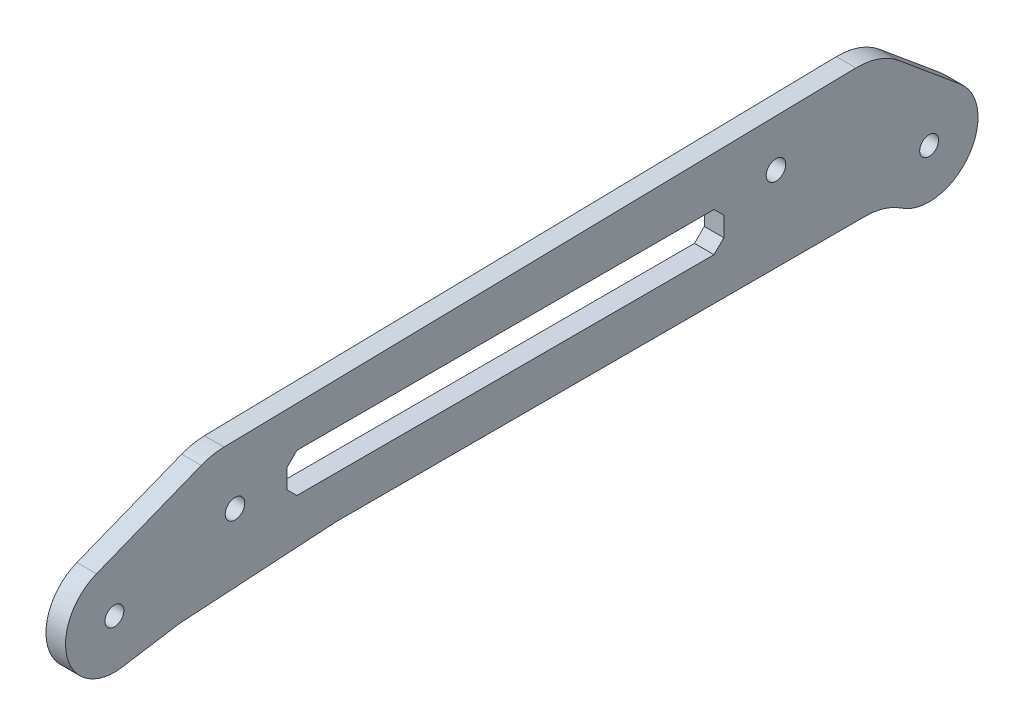
ISO-10303-21;
HEADER;
FILE_DESCRIPTION(('STEP AP214'),'2;1');
FILE_NAME('part.step','',(''),(''),'','','');
FILE_SCHEMA(('AUTOMOTIVE_DESIGN { 1 0 10303 214 1 1 1 1 }'));
ENDSEC;
DATA;
#1=APPLICATION_CONTEXT('core data for automotive mechanical design processes');
#2=APPLICATION_PROTOCOL_DEFINITION('international standard','automotive_design',2000,#1);
#3=PRODUCT_CONTEXT('',#1,'mechanical');
#4=PRODUCT('Part','Part','',(#3));
#5=PRODUCT_RELATED_PRODUCT_CATEGORY('part','',(#4));
#6=PRODUCT_DEFINITION_FORMATION('','',#4);
#7=PRODUCT_DEFINITION_CONTEXT('part definition',#1,'design');
#8=PRODUCT_DEFINITION('design','',#6,#7);
#9=PRODUCT_DEFINITION_SHAPE('','',#8);
#10=(LENGTH_UNIT() NAMED_UNIT(*) SI_UNIT(.MILLI.,.METRE.));
#11=(NAMED_UNIT(*) PLANE_ANGLE_UNIT() SI_UNIT($,.RADIAN.));
#12=(NAMED_UNIT(*) SI_UNIT($,.STERADIAN.) SOLID_ANGLE_UNIT());
#13=UNCERTAINTY_MEASURE_WITH_UNIT(LENGTH_MEASURE(1.E-05),#10,'distance_accuracy_value','');
#14=(GEOMETRIC_REPRESENTATION_CONTEXT(3) GLOBAL_UNCERTAINTY_ASSIGNED_CONTEXT((#13)) GLOBAL_UNIT_ASSIGNED_CONTEXT((#10,
#11,#12)) REPRESENTATION_CONTEXT('',''));
#15=CARTESIAN_POINT('',(0.,0.,0.));
#16=DIRECTION('',(0.,0.,1.));
#17=DIRECTION('',(1.,0.,0.));
#18=AXIS2_PLACEMENT_3D('',#15,#16,#17);
#19=CARTESIAN_POINT('',(1.5,17.5,17.5));
#20=DIRECTION('',(0.,0.707106781186548,0.707106781186547));
#21=DIRECTION('',(0.,-0.707106781186547,0.707106781186548));
#22=AXIS2_PLACEMENT_3D('',#19,#20,#21);
#23=PLANE('',#22);
#24=DIRECTION('',(0.,0.707106781186547,-0.707106781186548));
#25=VECTOR('',#24,1.);
#26=CARTESIAN_POINT('',(-1.5,17.5,17.5));
#27=LINE('',#26,#25);
#28=CARTESIAN_POINT('',(-1.5,1.99999999999999,33.));
#29=VERTEX_POINT('',#28);
#30=CARTESIAN_POINT('',(-1.5,3.49999999999999,31.5));
#31=VERTEX_POINT('',#30);
#32=EDGE_CURVE('E353',#29,#31,#27,.T.);
#33=ORIENTED_EDGE('',*,*,#32,.F.);
#34=DIRECTION('',(-1.,0.,0.));
#35=VECTOR('',#34,1.);
#36=CARTESIAN_POINT('',(1.5,1.99999999999999,33.));
#37=LINE('',#36,#35);
#38=CARTESIAN_POINT('',(1.5,1.99999999999999,33.));
#39=VERTEX_POINT('',#38);
#40=EDGE_CURVE('E218',#39,#29,#37,.T.);
#41=ORIENTED_EDGE('',*,*,#40,.F.);
#42=DIRECTION('',(0.,0.707106781186547,-0.707106781186548));
#43=VECTOR('',#42,1.);
#44=CARTESIAN_POINT('',(1.5,17.5,17.5));
#45=LINE('',#44,#43);
#46=CARTESIAN_POINT('',(1.5,3.49999999999999,31.5));
#47=VERTEX_POINT('',#46);
#48=EDGE_CURVE('E449',#39,#47,#45,.T.);
#49=ORIENTED_EDGE('',*,*,#48,.T.);
#50=DIRECTION('',(-1.,0.,0.));
#51=VECTOR('',#50,1.);
#52=CARTESIAN_POINT('',(1.5,3.49999999999999,31.5));
#53=LINE('',#52,#51);
#54=EDGE_CURVE('E206',#47,#31,#53,.T.);
#55=ORIENTED_EDGE('',*,*,#54,.T.);
#56=EDGE_LOOP('',(#33,#41,#49,#55));
#57=FACE_BOUND('',#56,.T.);
#58=ADVANCED_FACE('F37',(#57),#23,.T.);
#59=CARTESIAN_POINT('',(1.5,1.99999999999999,0.));
#60=DIRECTION('',(0.,1.,0.));
#61=DIRECTION('',(0.,0.,1.));
#62=AXIS2_PLACEMENT_3D('',#59,#60,#61);
#63=PLANE('',#62);
#64=DIRECTION('',(0.,0.,-1.));
#65=VECTOR('',#64,1.);
#66=CARTESIAN_POINT('',(-1.5,1.99999999999999,0.));
#67=LINE('',#66,#65);
#68=CARTESIAN_POINT('',(-1.5,1.99999999999999,97.));
#69=VERTEX_POINT('',#68);
#70=EDGE_CURVE('E356',#69,#29,#67,.T.);
#71=ORIENTED_EDGE('',*,*,#70,.F.);
#72=DIRECTION('',(-1.,0.,0.));
#73=VECTOR('',#72,1.);
#74=CARTESIAN_POINT('',(1.5,1.99999999999999,97.));
#75=LINE('',#74,#73);
#76=CARTESIAN_POINT('',(1.5,1.99999999999999,97.));
#77=VERTEX_POINT('',#76);
#78=EDGE_CURVE('E392',#77,#69,#75,.T.);
#79=ORIENTED_EDGE('',*,*,#78,.F.);
#80=DIRECTION('',(0.,0.,-1.));
#81=VECTOR('',#80,1.);
#82=CARTESIAN_POINT('',(1.5,1.99999999999999,0.));
#83=LINE('',#82,#81);
#84=EDGE_CURVE('E452',#77,#39,#83,.T.);
#85=ORIENTED_EDGE('',*,*,#84,.T.);
#86=ORIENTED_EDGE('',*,*,#40,.T.);
#87=EDGE_LOOP('',(#71,#79,#85,#86));
#88=FACE_BOUND('',#87,.T.);
#89=ADVANCED_FACE('F276',(#88),#63,.T.);
#90=CARTESIAN_POINT('',(1.5,-47.5,47.5));
#91=DIRECTION('',(0.,0.707106781186548,-0.707106781186547));
#92=DIRECTION('',(0.,0.707106781186547,0.707106781186548));
#93=AXIS2_PLACEMENT_3D('',#90,#91,#92);
#94=PLANE('',#93);
#95=DIRECTION('',(0.,-0.707106781186547,-0.707106781186548));
#96=VECTOR('',#95,1.);
#97=CARTESIAN_POINT('',(-1.5,-47.5,47.5));
#98=LINE('',#97,#96);
#99=CARTESIAN_POINT('',(-1.5,3.49999999999999,98.5));
#100=VERTEX_POINT('',#99);
#101=EDGE_CURVE('E359',#100,#69,#98,.T.);
#102=ORIENTED_EDGE('',*,*,#101,.F.);
#103=DIRECTION('',(-1.,0.,0.));
#104=VECTOR('',#103,1.);
#105=CARTESIAN_POINT('',(1.5,3.49999999999999,98.5));
#106=LINE('',#105,#104);
#107=CARTESIAN_POINT('',(1.5,3.49999999999999,98.5));
#108=VERTEX_POINT('',#107);
#109=EDGE_CURVE('E390',#108,#100,#106,.T.);
#110=ORIENTED_EDGE('',*,*,#109,.F.);
#111=DIRECTION('',(0.,-0.707106781186547,-0.707106781186548));
#112=VECTOR('',#111,1.);
#113=CARTESIAN_POINT('',(1.5,-47.5,47.5));
#114=LINE('',#113,#112);
#115=EDGE_CURVE('E455',#108,#77,#114,.T.);
#116=ORIENTED_EDGE('',*,*,#115,.T.);
#117=ORIENTED_EDGE('',*,*,#78,.T.);
#118=EDGE_LOOP('',(#102,#110,#116,#117));
#119=FACE_BOUND('',#118,.T.);
#120=ADVANCED_FACE('F282',(#119),#94,.T.);
#121=CARTESIAN_POINT('',(1.5,0.,98.5));
#122=DIRECTION('',(0.,0.,-1.));
#123=DIRECTION('',(-1.,0.,0.));
#124=AXIS2_PLACEMENT_3D('',#121,#122,#123);
#125=PLANE('',#124);
#126=DIRECTION('',(0.,-1.,0.));
#127=VECTOR('',#126,1.);
#128=CARTESIAN_POINT('',(-1.5,0.,98.5));
#129=LINE('',#128,#127);
#130=CARTESIAN_POINT('',(-1.5,6.49999999999998,98.5));
#131=VERTEX_POINT('',#130);
#132=EDGE_CURVE('E362',#131,#100,#129,.T.);
#133=ORIENTED_EDGE('',*,*,#132,.F.);
#134=DIRECTION('',(-1.,0.,0.));
#135=VECTOR('',#134,1.);
#136=CARTESIAN_POINT('',(1.5,6.49999999999998,98.5));
#137=LINE('',#136,#135);
#138=CARTESIAN_POINT('',(1.5,6.49999999999998,98.5));
#139=VERTEX_POINT('',#138);
#140=EDGE_CURVE('E388',#139,#131,#137,.T.);
#141=ORIENTED_EDGE('',*,*,#140,.F.);
#142=DIRECTION('',(0.,-1.,0.));
#143=VECTOR('',#142,1.);
#144=CARTESIAN_POINT('',(1.5,0.,98.5));
#145=LINE('',#144,#143);
#146=EDGE_CURVE('E458',#139,#108,#145,.T.);
#147=ORIENTED_EDGE('',*,*,#146,.T.);
#148=ORIENTED_EDGE('',*,*,#109,.T.);
#149=EDGE_LOOP('',(#133,#141,#147,#148));
#150=FACE_BOUND('',#149,.T.);
#151=ADVANCED_FACE('F483',(#150),#125,.T.);
#152=CARTESIAN_POINT('',(1.5,52.5,52.4999999999999));
#153=DIRECTION('',(0.,0.707106781186548,0.707106781186547));
#154=DIRECTION('',(0.,-0.707106781186547,0.707106781186548));
#155=AXIS2_PLACEMENT_3D('',#152,#153,#154);
#156=PLANE('',#155);
#157=DIRECTION('',(0.,0.707106781186547,-0.707106781186548));
#158=VECTOR('',#157,1.);
#159=CARTESIAN_POINT('',(-1.5,52.5,52.4999999999999));
#160=LINE('',#159,#158);
#161=CARTESIAN_POINT('',(-1.5,7.99999999999999,97.));
#162=VERTEX_POINT('',#161);
#163=EDGE_CURVE('E365',#131,#162,#160,.T.);
#164=ORIENTED_EDGE('',*,*,#163,.T.);
#165=DIRECTION('',(-1.,0.,0.));
#166=VECTOR('',#165,1.);
#167=CARTESIAN_POINT('',(1.5,7.99999999999999,97.));
#168=LINE('',#167,#166);
#169=CARTESIAN_POINT('',(1.5,7.99999999999999,97.));
#170=VERTEX_POINT('',#169);
#171=EDGE_CURVE('E385',#170,#162,#168,.T.);
#172=ORIENTED_EDGE('',*,*,#171,.F.);
#173=DIRECTION('',(0.,0.707106781186547,-0.707106781186548));
#174=VECTOR('',#173,1.);
#175=CARTESIAN_POINT('',(1.5,52.5,52.4999999999999));
#176=LINE('',#175,#174);
#177=EDGE_CURVE('E461',#139,#170,#176,.T.);
#178=ORIENTED_EDGE('',*,*,#177,.F.);
#179=ORIENTED_EDGE('',*,*,#140,.T.);
#180=EDGE_LOOP('',(#164,#172,#178,#179));
#181=FACE_BOUND('',#180,.T.);
#182=ADVANCED_FACE('F488',(#181),#156,.F.);
#183=CARTESIAN_POINT('',(1.5,7.99999999999999,0.));
#184=DIRECTION('',(0.,1.,0.));
#185=DIRECTION('',(0.,0.,1.));
#186=AXIS2_PLACEMENT_3D('',#183,#184,#185);
#187=PLANE('',#186);
#188=DIRECTION('',(0.,0.,-1.));
#189=VECTOR('',#188,1.);
#190=CARTESIAN_POINT('',(-1.5,7.99999999999999,0.));
#191=LINE('',#190,#189);
#192=CARTESIAN_POINT('',(-1.5,7.99999999999999,33.));
#193=VERTEX_POINT('',#192);
#194=EDGE_CURVE('E368',#162,#193,#191,.T.);
#195=ORIENTED_EDGE('',*,*,#194,.T.);
#196=DIRECTION('',(-1.,0.,0.));
#197=VECTOR('',#196,1.);
#198=CARTESIAN_POINT('',(1.5,7.99999999999999,33.));
#199=LINE('',#198,#197);
#200=CARTESIAN_POINT('',(1.5,7.99999999999999,33.));
#201=VERTEX_POINT('',#200);
#202=EDGE_CURVE('E382',#201,#193,#199,.T.);
#203=ORIENTED_EDGE('',*,*,#202,.F.);
#204=DIRECTION('',(0.,0.,-1.));
#205=VECTOR('',#204,1.);
#206=CARTESIAN_POINT('',(1.5,7.99999999999999,0.));
#207=LINE('',#206,#205);
#208=EDGE_CURVE('E464',#170,#201,#207,.T.);
#209=ORIENTED_EDGE('',*,*,#208,.F.);
#210=ORIENTED_EDGE('',*,*,#171,.T.);
#211=EDGE_LOOP('',(#195,#203,#209,#210));
#212=FACE_BOUND('',#211,.T.);
#213=ADVANCED_FACE('F490',(#212),#187,.F.);
#214=CARTESIAN_POINT('',(1.5,-12.5,12.5));
#215=DIRECTION('',(0.,0.707106781186548,-0.707106781186547));
#216=DIRECTION('',(0.,0.707106781186547,0.707106781186548));
#217=AXIS2_PLACEMENT_3D('',#214,#215,#216);
#218=PLANE('',#217);
#219=DIRECTION('',(0.,-0.707106781186547,-0.707106781186548));
#220=VECTOR('',#219,1.);
#221=CARTESIAN_POINT('',(-1.5,-12.5,12.5));
#222=LINE('',#221,#220);
#223=CARTESIAN_POINT('',(-1.5,6.49999999999999,31.5));
#224=VERTEX_POINT('',#223);
#225=EDGE_CURVE('E371',#193,#224,#222,.T.);
#226=ORIENTED_EDGE('',*,*,#225,.T.);
#227=DIRECTION('',(-1.,0.,0.));
#228=VECTOR('',#227,1.);
#229=CARTESIAN_POINT('',(1.5,6.49999999999999,31.5));
#230=LINE('',#229,#228);
#231=CARTESIAN_POINT('',(1.5,6.49999999999999,31.5));
#232=VERTEX_POINT('',#231);
#233=EDGE_CURVE('E209',#232,#224,#230,.T.);
#234=ORIENTED_EDGE('',*,*,#233,.F.);
#235=DIRECTION('',(0.,-0.707106781186547,-0.707106781186548));
#236=VECTOR('',#235,1.);
#237=CARTESIAN_POINT('',(1.5,-12.5,12.5));
#238=LINE('',#237,#236);
#239=EDGE_CURVE('E404',#201,#232,#238,.T.);
#240=ORIENTED_EDGE('',*,*,#239,.F.);
#241=ORIENTED_EDGE('',*,*,#202,.T.);
#242=EDGE_LOOP('',(#226,#234,#240,#241));
#243=FACE_BOUND('',#242,.T.);
#244=ADVANCED_FACE('F324',(#243),#218,.F.);
#245=CARTESIAN_POINT('',(1.5,0.,0.));
#246=DIRECTION('',(-1.,0.,0.));
#247=DIRECTION('',(0.,0.,1.));
#248=AXIS2_PLACEMENT_3D('',#245,#246,#247);
#249=CYLINDRICAL_SURFACE('',#248,7.5);
#250=CARTESIAN_POINT('',(1.5,0.,0.));
#251=DIRECTION('',(1.,0.,0.));
#252=DIRECTION('',(0.,0.,-1.));
#253=AXIS2_PLACEMENT_3D('',#250,#251,#252);
#254=CIRCLE('',#253,7.5);
#255=CARTESIAN_POINT('',(1.5,-6.21428571428572,4.19912527334258));
#256=VERTEX_POINT('',#255);
#257=CARTESIAN_POINT('',(1.5,5.76461168935148,-4.79783827061649));
#258=VERTEX_POINT('',#257);
#259=EDGE_CURVE('E180',#256,#258,#254,.T.);
#260=ORIENTED_EDGE('',*,*,#259,.F.);
#261=DIRECTION('',(-1.,0.,0.));
#262=VECTOR('',#261,1.);
#263=CARTESIAN_POINT('',(1.5,-6.21428571428572,4.19912527334258));
#264=LINE('',#263,#262);
#265=CARTESIAN_POINT('',(-1.5,-6.21428571428572,4.19912527334258));
#266=VERTEX_POINT('',#265);
#267=EDGE_CURVE('E241',#256,#266,#264,.T.);
#268=ORIENTED_EDGE('',*,*,#267,.T.);
#269=CARTESIAN_POINT('',(-1.5,0.,0.));
#270=DIRECTION('',(1.,0.,0.));
#271=DIRECTION('',(0.,0.,-1.));
#272=AXIS2_PLACEMENT_3D('',#269,#270,#271);
#273=CIRCLE('',#272,7.5);
#274=CARTESIAN_POINT('',(-1.5,5.76461168935148,-4.79783827061649));
#275=VERTEX_POINT('',#274);
#276=EDGE_CURVE('E205',#266,#275,#273,.T.);
#277=ORIENTED_EDGE('',*,*,#276,.T.);
#278=DIRECTION('',(-1.,0.,0.));
#279=VECTOR('',#278,1.);
#280=CARTESIAN_POINT('',(1.5,5.76461168935148,-4.79783827061649));
#281=LINE('',#280,#279);
#282=EDGE_CURVE('E197',#258,#275,#281,.T.);
#283=ORIENTED_EDGE('',*,*,#282,.F.);
#284=EDGE_LOOP('',(#260,#268,#277,#283));
#285=FACE_BOUND('',#284,.T.);
#286=ADVANCED_FACE('F203',(#285),#249,.T.);
#287=CARTESIAN_POINT('',(1.5,5.76461168935148,-4.79783827061649));
#288=DIRECTION('',(0.,0.768614891913531,-0.639711769415532));
#289=DIRECTION('',(0.,0.639711769415533,0.768614891913531));
#290=AXIS2_PLACEMENT_3D('',#287,#288,#289);
#291=PLANE('',#290);
#292=DIRECTION('',(0.,-0.639711769415533,-0.768614891913531));
#293=VECTOR('',#292,1.);
#294=CARTESIAN_POINT('',(-1.5,5.76461168935148,-4.79783827061649));
#295=LINE('',#294,#293);
#296=CARTESIAN_POINT('',(-1.5,13.6153297274053,4.63481419062463));
#297=VERTEX_POINT('',#296);
#298=EDGE_CURVE('E412',#297,#275,#295,.T.);
#299=ORIENTED_EDGE('',*,*,#298,.F.);
#300=DIRECTION('',(-1.,0.,0.));
#301=VECTOR('',#300,1.);
#302=CARTESIAN_POINT('',(1.5,13.6153297274053,4.63481419062463));
#303=LINE('',#302,#301);
#304=CARTESIAN_POINT('',(1.5,13.6153297274053,4.63481419062463));
#305=VERTEX_POINT('',#304);
#306=EDGE_CURVE('E199',#297,#305,#303,.F.);
#307=ORIENTED_EDGE('',*,*,#306,.T.);
#308=DIRECTION('',(0.,-0.639711769415533,-0.768614891913531));
#309=VECTOR('',#308,1.);
#310=CARTESIAN_POINT('',(1.5,5.76461168935148,-4.79783827061649));
#311=LINE('',#310,#309);
#312=EDGE_CURVE('E184',#305,#258,#311,.T.);
#313=ORIENTED_EDGE('',*,*,#312,.T.);
#314=ORIENTED_EDGE('',*,*,#282,.T.);
#315=EDGE_LOOP('',(#299,#307,#313,#314));
#316=FACE_BOUND('',#315,.T.);
#317=ADVANCED_FACE('F196',(#316),#291,.T.);
#318=CARTESIAN_POINT('',(1.5,16.1401964748698,0.31493066292429));
#319=DIRECTION('',(0.,0.99980969146056,0.0195084817845964));
#320=DIRECTION('',(0.,-0.0195084817845964,0.99980969146056));
#321=AXIS2_PLACEMENT_3D('',#318,#319,#320);
#322=PLANE('',#321);
#323=DIRECTION('',(0.,0.0195084817845964,-0.99980969146056));
#324=VECTOR('',#323,1.);
#325=CARTESIAN_POINT('',(1.5,16.1401964748698,0.31493066292429));
#326=LINE('',#325,#324);
#327=CARTESIAN_POINT('',(1.5,14.0352193900822,108.195006258286));
#328=VERTEX_POINT('',#327);
#329=CARTESIAN_POINT('',(1.5,15.9272777228756,11.2270167026259));
#330=VERTEX_POINT('',#329);
#331=EDGE_CURVE('E200',#328,#330,#326,.T.);
#332=ORIENTED_EDGE('',*,*,#331,.T.);
#333=DIRECTION('',(-1.,0.,0.));
#334=VECTOR('',#333,1.);
#335=CARTESIAN_POINT('',(1.5,15.9272777228756,11.2270167026259));
#336=LINE('',#335,#334);
#337=CARTESIAN_POINT('',(-1.5,15.9272777228756,11.2270167026259));
#338=VERTEX_POINT('',#337);
#339=EDGE_CURVE('E217',#330,#338,#336,.T.);
#340=ORIENTED_EDGE('',*,*,#339,.T.);
#341=DIRECTION('',(0.,0.0195084817845964,-0.99980969146056));
#342=VECTOR('',#341,1.);
#343=CARTESIAN_POINT('',(-1.5,16.1401964748698,0.31493066292429));
#344=LINE('',#343,#342);
#345=CARTESIAN_POINT('',(-1.5,14.0352193900822,108.195006258286));
#346=VERTEX_POINT('',#345);
#347=EDGE_CURVE('E414',#346,#338,#344,.T.);
#348=ORIENTED_EDGE('',*,*,#347,.F.);
#349=DIRECTION('',(-1.,0.,0.));
#350=VECTOR('',#349,1.);
#351=CARTESIAN_POINT('',(1.5,14.0352193900822,108.195006258286));
#352=LINE('',#351,#350);
#353=EDGE_CURVE('E215',#346,#328,#352,.F.);
#354=ORIENTED_EDGE('',*,*,#353,.T.);
#355=EDGE_LOOP('',(#332,#340,#348,#354));
#356=FACE_BOUND('',#355,.T.);
#357=ADVANCED_FACE('F315',(#356),#322,.T.);
#358=CARTESIAN_POINT('',(1.5,49.7343916487453,19.6761869214032));
#359=DIRECTION('',(0.,0.929872776298727,0.367881257878812));
#360=DIRECTION('',(0.,-0.367881257878812,0.929872776298727));
#361=AXIS2_PLACEMENT_3D('',#358,#359,#360);
#362=PLANE('',#361);
#363=DIRECTION('',(0.,0.367881257878812,-0.929872776298727));
#364=VECTOR('',#363,1.);
#365=CARTESIAN_POINT('',(1.5,49.7343916487453,19.6761869214032));
#366=LINE('',#365,#364);
#367=CARTESIAN_POINT('',(1.5,6.97404582224044,127.759109434091));
#368=VERTEX_POINT('',#367);
#369=CARTESIAN_POINT('',(1.5,13.3358502384639,111.678734019228));
#370=VERTEX_POINT('',#369);
#371=EDGE_CURVE('E424',#368,#370,#366,.T.);
#372=ORIENTED_EDGE('',*,*,#371,.T.);
#373=DIRECTION('',(-1.,0.,0.));
#374=VECTOR('',#373,1.);
#375=CARTESIAN_POINT('',(1.5,13.3358502384639,111.678734019228));
#376=LINE('',#375,#374);
#377=CARTESIAN_POINT('',(-1.5,13.3358502384639,111.678734019228));
#378=VERTEX_POINT('',#377);
#379=EDGE_CURVE('E243',#370,#378,#376,.T.);
#380=ORIENTED_EDGE('',*,*,#379,.T.);
#381=DIRECTION('',(0.,0.367881257878812,-0.929872776298727));
#382=VECTOR('',#381,1.);
#383=CARTESIAN_POINT('',(-1.5,49.7343916487453,19.6761869214032));
#384=LINE('',#383,#382);
#385=CARTESIAN_POINT('',(-1.5,6.97404582224044,127.759109434091));
#386=VERTEX_POINT('',#385);
#387=EDGE_CURVE('E416',#386,#378,#384,.T.);
#388=ORIENTED_EDGE('',*,*,#387,.F.);
#389=DIRECTION('',(-1.,0.,0.));
#390=VECTOR('',#389,1.);
#391=CARTESIAN_POINT('',(1.5,6.97404582224044,127.759109434091));
#392=LINE('',#391,#390);
#393=EDGE_CURVE('E207',#368,#386,#392,.T.);
#394=ORIENTED_EDGE('',*,*,#393,.F.);
#395=EDGE_LOOP('',(#372,#380,#388,#394));
#396=FACE_BOUND('',#395,.T.);
#397=ADVANCED_FACE('F311',(#396),#362,.T.);
#398=CARTESIAN_POINT('',(1.5,0.,125.));
#399=DIRECTION('',(-1.,0.,0.));
#400=DIRECTION('',(0.,0.,1.));
#401=AXIS2_PLACEMENT_3D('',#398,#399,#400);
#402=CYLINDRICAL_SURFACE('',#401,7.50000000000001);
#403=CARTESIAN_POINT('',(-1.5,0.,125.));
#404=DIRECTION('',(1.,0.,0.));
#405=DIRECTION('',(0.,0.,-1.));
#406=AXIS2_PLACEMENT_3D('',#403,#404,#405);
#407=CIRCLE('',#406,7.50000000000001);
#408=CARTESIAN_POINT('',(-1.5,-7.40640747228635,123.818844483372));
#409=VERTEX_POINT('',#408);
#410=EDGE_CURVE('E344',#386,#409,#407,.T.);
#411=ORIENTED_EDGE('',*,*,#410,.T.);
#412=DIRECTION('',(-1.,0.,0.));
#413=VECTOR('',#412,1.);
#414=CARTESIAN_POINT('',(1.5,-7.40640747228635,123.818844483372));
#415=LINE('',#414,#413);
#416=CARTESIAN_POINT('',(1.5,-7.40640747228635,123.818844483372));
#417=VERTEX_POINT('',#416);
#418=EDGE_CURVE('E211',#417,#409,#415,.T.);
#419=ORIENTED_EDGE('',*,*,#418,.F.);
#420=CARTESIAN_POINT('',(1.5,0.,125.));
#421=DIRECTION('',(1.,0.,0.));
#422=DIRECTION('',(0.,0.,-1.));
#423=AXIS2_PLACEMENT_3D('',#420,#421,#422);
#424=CIRCLE('',#423,7.50000000000001);
#425=EDGE_CURVE('E432',#368,#417,#424,.T.);
#426=ORIENTED_EDGE('',*,*,#425,.F.);
#427=ORIENTED_EDGE('',*,*,#393,.T.);
#428=EDGE_LOOP('',(#411,#419,#426,#427));
#429=FACE_BOUND('',#428,.T.);
#430=ADVANCED_FACE('F307',(#429),#402,.T.);
#431=CARTESIAN_POINT('',(1.5,12.0338570705745,1.9191297155079));
#432=DIRECTION('',(0.,-0.987520996304844,-0.157487402217094));
#433=DIRECTION('',(0.,0.157487402217094,-0.987520996304844));
#434=AXIS2_PLACEMENT_3D('',#431,#432,#433);
#435=PLANE('',#434);
#436=DIRECTION('',(0.,-0.157487402217094,0.987520996304844));
#437=VECTOR('',#436,1.);
#438=CARTESIAN_POINT('',(-1.5,12.0338570705745,1.9191297155079));
#439=LINE('',#438,#437);
#440=CARTESIAN_POINT('',(-1.5,-6.07543657815531,115.473023262617));
#441=VERTEX_POINT('',#440);
#442=EDGE_CURVE('E342',#441,#409,#439,.T.);
#443=ORIENTED_EDGE('',*,*,#442,.F.);
#444=DIRECTION('',(-1.,0.,0.));
#445=VECTOR('',#444,1.);
#446=CARTESIAN_POINT('',(1.5,-6.07543657815531,115.473023262617));
#447=LINE('',#446,#445);
#448=CARTESIAN_POINT('',(1.5,-6.07543657815531,115.473023262617));
#449=VERTEX_POINT('',#448);
#450=EDGE_CURVE('E239',#441,#449,#447,.F.);
#451=ORIENTED_EDGE('',*,*,#450,.T.);
#452=DIRECTION('',(0.,-0.157487402217094,0.987520996304844));
#453=VECTOR('',#452,1.);
#454=CARTESIAN_POINT('',(1.5,12.0338570705745,1.9191297155079));
#455=LINE('',#454,#453);
#456=EDGE_CURVE('E437',#449,#417,#455,.T.);
#457=ORIENTED_EDGE('',*,*,#456,.T.);
#458=ORIENTED_EDGE('',*,*,#418,.T.);
#459=EDGE_LOOP('',(#443,#451,#457,#458));
#460=FACE_BOUND('',#459,.T.);
#461=ADVANCED_FACE('F303',(#460),#435,.T.);
#462=CARTESIAN_POINT('',(1.5,1.18287937743191,0.0739299610894947));
#463=DIRECTION('',(0.,0.998052578482889,0.0623782861551807));
#464=DIRECTION('',(0.,-0.0623782861551807,0.998052578482889));
#465=AXIS2_PLACEMENT_3D('',#462,#463,#464);
#466=PLANE('',#465);
#467=DIRECTION('',(0.,0.0623782861551807,-0.998052578482889));
#468=VECTOR('',#467,1.);
#469=CARTESIAN_POINT('',(-1.5,1.18287937743191,0.0739299610894947));
#470=LINE('',#469,#468);
#471=CARTESIAN_POINT('',(-1.5,-5.97012075637486,114.521932101998));
#472=VERTEX_POINT('',#471);
#473=CARTESIAN_POINT('',(-1.5,-4.51947421517113,91.3115874427379));
#474=VERTEX_POINT('',#473);
#475=EDGE_CURVE('E262',#472,#474,#470,.T.);
#476=ORIENTED_EDGE('',*,*,#475,.T.);
#477=DIRECTION('',(-1.,0.,0.));
#478=VECTOR('',#477,1.);
#479=CARTESIAN_POINT('',(1.5,-4.51947421517113,91.3115874427378));
#480=LINE('',#479,#478);
#481=CARTESIAN_POINT('',(1.5,-4.51947421517113,91.3115874427379));
#482=VERTEX_POINT('',#481);
#483=EDGE_CURVE('E237',#474,#482,#480,.F.);
#484=ORIENTED_EDGE('',*,*,#483,.T.);
#485=DIRECTION('',(0.,0.0623782861551807,-0.998052578482889));
#486=VECTOR('',#485,1.);
#487=CARTESIAN_POINT('',(1.5,1.18287937743191,0.0739299610894947));
#488=LINE('',#487,#486);
#489=CARTESIAN_POINT('',(1.5,-5.97012075637486,114.521932101998));
#490=VERTEX_POINT('',#489);
#491=EDGE_CURVE('E439',#490,#482,#488,.T.);
#492=ORIENTED_EDGE('',*,*,#491,.F.);
#493=DIRECTION('',(-1.,0.,0.));
#494=VECTOR('',#493,1.);
#495=CARTESIAN_POINT('',(1.5,-5.97012075637486,114.521932101997));
#496=LINE('',#495,#494);
#497=EDGE_CURVE('E234',#490,#472,#496,.T.);
#498=ORIENTED_EDGE('',*,*,#497,.T.);
#499=EDGE_LOOP('',(#476,#484,#492,#498));
#500=FACE_BOUND('',#499,.T.);
#501=ADVANCED_FACE('F300',(#500),#466,.F.);
#502=CARTESIAN_POINT('',(1.5,0.,31.5));
#503=DIRECTION('',(0.,0.,-1.));
#504=DIRECTION('',(-1.,0.,0.));
#505=AXIS2_PLACEMENT_3D('',#502,#503,#504);
#506=PLANE('',#505);
#507=DIRECTION('',(0.,-1.,0.));
#508=VECTOR('',#507,1.);
#509=CARTESIAN_POINT('',(-1.5,0.,31.5));
#510=LINE('',#509,#508);
#511=EDGE_CURVE('E374',#224,#31,#510,.T.);
#512=ORIENTED_EDGE('',*,*,#511,.T.);
#513=ORIENTED_EDGE('',*,*,#54,.F.);
#514=DIRECTION('',(0.,-1.,0.));
#515=VECTOR('',#514,1.);
#516=CARTESIAN_POINT('',(1.5,0.,31.5));
#517=LINE('',#516,#515);
#518=EDGE_CURVE('E400',#232,#47,#517,.T.);
#519=ORIENTED_EDGE('',*,*,#518,.F.);
#520=ORIENTED_EDGE('',*,*,#233,.T.);
#521=EDGE_LOOP('',(#512,#513,#519,#520));
#522=FACE_BOUND('',#521,.T.);
#523=ADVANCED_FACE('F292',(#522),#506,.F.);
#524=CARTESIAN_POINT('',(1.5,8.49999999999999,23.5));
#525=DIRECTION('',(-1.,0.,0.));
#526=DIRECTION('',(0.,0.,1.));
#527=AXIS2_PLACEMENT_3D('',#524,#525,#526);
#528=CYLINDRICAL_SURFACE('',#527,1.5);
#529=CARTESIAN_POINT('',(1.5,8.49999999999999,23.5));
#530=DIRECTION('',(1.,0.,0.));
#531=DIRECTION('',(0.,0.,-1.));
#532=AXIS2_PLACEMENT_3D('',#529,#530,#531);
#533=CIRCLE('',#532,1.5);
#534=CARTESIAN_POINT('',(1.5,8.49999999999999,22.));
#535=VERTEX_POINT('',#534);
#536=EDGE_CURVE('E446',#535,#535,#533,.T.);
#537=ORIENTED_EDGE('',*,*,#536,.T.);
#538=EDGE_LOOP('',(#537));
#539=FACE_BOUND('',#538,.T.);
#540=CARTESIAN_POINT('',(-1.5,8.49999999999999,23.5));
#541=DIRECTION('',(1.,0.,0.));
#542=DIRECTION('',(0.,0.,-1.));
#543=AXIS2_PLACEMENT_3D('',#540,#541,#542);
#544=CIRCLE('',#543,1.5);
#545=CARTESIAN_POINT('',(-1.5,8.49999999999999,22.));
#546=VERTEX_POINT('',#545);
#547=EDGE_CURVE('E350',#546,#546,#544,.T.);
#548=ORIENTED_EDGE('',*,*,#547,.F.);
#549=EDGE_LOOP('',(#548));
#550=FACE_BOUND('',#549,.T.);
#551=ADVANCED_FACE('F288',(#539,#550),#528,.F.);
#552=CARTESIAN_POINT('',(1.5,4.99999999999999,106.5));
#553=DIRECTION('',(-1.,0.,0.));
#554=DIRECTION('',(0.,0.,1.));
#555=AXIS2_PLACEMENT_3D('',#552,#553,#554);
#556=CYLINDRICAL_SURFACE('',#555,1.5);
#557=CARTESIAN_POINT('',(1.5,4.99999999999999,106.5));
#558=DIRECTION('',(1.,0.,0.));
#559=DIRECTION('',(0.,0.,-1.));
#560=AXIS2_PLACEMENT_3D('',#557,#558,#559);
#561=CIRCLE('',#560,1.5);
#562=CARTESIAN_POINT('',(1.5,4.99999999999999,105.));
#563=VERTEX_POINT('',#562);
#564=EDGE_CURVE('E443',#563,#563,#561,.T.);
#565=ORIENTED_EDGE('',*,*,#564,.T.);
#566=EDGE_LOOP('',(#565));
#567=FACE_BOUND('',#566,.T.);
#568=CARTESIAN_POINT('',(-1.5,4.99999999999999,106.5));
#569=DIRECTION('',(1.,0.,0.));
#570=DIRECTION('',(0.,0.,-1.));
#571=AXIS2_PLACEMENT_3D('',#568,#569,#570);
#572=CIRCLE('',#571,1.5);
#573=CARTESIAN_POINT('',(-1.5,4.99999999999999,105.));
#574=VERTEX_POINT('',#573);
#575=EDGE_CURVE('E261',#574,#574,#572,.T.);
#576=ORIENTED_EDGE('',*,*,#575,.F.);
#577=EDGE_LOOP('',(#576));
#578=FACE_BOUND('',#577,.T.);
#579=ADVANCED_FACE('F291',(#567,#578),#556,.F.);
#580=CARTESIAN_POINT('',(1.5,-4.50000000000001,0.));
#581=DIRECTION('',(0.,1.,0.));
#582=DIRECTION('',(0.,0.,1.));
#583=AXIS2_PLACEMENT_3D('',#580,#581,#582);
#584=PLANE('',#583);
#585=DIRECTION('',(0.,0.,-1.));
#586=VECTOR('',#585,1.);
#587=CARTESIAN_POINT('',(1.5,-4.50000000000001,0.));
#588=LINE('',#587,#586);
#589=CARTESIAN_POINT('',(1.5,-4.50000000000001,90.687804581186));
#590=VERTEX_POINT('',#589);
#591=CARTESIAN_POINT('',(1.5,-4.50000000000001,9.7979589711327));
#592=VERTEX_POINT('',#591);
#593=EDGE_CURVE('E441',#590,#592,#588,.T.);
#594=ORIENTED_EDGE('',*,*,#593,.F.);
#595=DIRECTION('',(-1.,0.,0.));
#596=VECTOR('',#595,1.);
#597=CARTESIAN_POINT('',(-1.5,-4.50000000000001,90.687804581186));
#598=LINE('',#597,#596);
#599=CARTESIAN_POINT('',(-1.5,-4.50000000000001,90.687804581186));
#600=VERTEX_POINT('',#599);
#601=EDGE_CURVE('E231',#590,#600,#598,.T.);
#602=ORIENTED_EDGE('',*,*,#601,.T.);
#603=DIRECTION('',(0.,0.,-1.));
#604=VECTOR('',#603,1.);
#605=CARTESIAN_POINT('',(-1.5,-4.50000000000001,0.));
#606=LINE('',#605,#604);
#607=CARTESIAN_POINT('',(-1.5,-4.50000000000001,9.7979589711327));
#608=VERTEX_POINT('',#607);
#609=EDGE_CURVE('E257',#600,#608,#606,.T.);
#610=ORIENTED_EDGE('',*,*,#609,.T.);
#611=DIRECTION('',(1.,0.,0.));
#612=VECTOR('',#611,1.);
#613=CARTESIAN_POINT('',(1.5,-4.50000000000001,9.7979589711327));
#614=LINE('',#613,#612);
#615=EDGE_CURVE('E52',#608,#592,#614,.T.);
#616=ORIENTED_EDGE('',*,*,#615,.T.);
#617=EDGE_LOOP('',(#594,#602,#610,#616));
#618=FACE_BOUND('',#617,.T.);
#619=ADVANCED_FACE('F259',(#618),#584,.F.);
#620=CARTESIAN_POINT('',(1.5,0.,0.));
#621=DIRECTION('',(-1.,0.,0.));
#622=DIRECTION('',(0.,0.,1.));
#623=AXIS2_PLACEMENT_3D('',#620,#621,#622);
#624=CYLINDRICAL_SURFACE('',#623,1.45);
#625=CARTESIAN_POINT('',(1.5,0.,0.));
#626=DIRECTION('',(1.,0.,0.));
#627=DIRECTION('',(0.,0.,-1.));
#628=AXIS2_PLACEMENT_3D('',#625,#626,#627);
#629=CIRCLE('',#628,1.45);
#630=CARTESIAN_POINT('',(1.5,0.,-1.45));
#631=VERTEX_POINT('',#630);
#632=EDGE_CURVE('E191',#631,#631,#629,.T.);
#633=ORIENTED_EDGE('',*,*,#632,.T.);
#634=EDGE_LOOP('',(#633));
#635=FACE_BOUND('',#634,.T.);
#636=CARTESIAN_POINT('',(-1.5,0.,0.));
#637=DIRECTION('',(1.,0.,0.));
#638=DIRECTION('',(0.,0.,-1.));
#639=AXIS2_PLACEMENT_3D('',#636,#637,#638);
#640=CIRCLE('',#639,1.45);
#641=CARTESIAN_POINT('',(-1.5,0.,-1.45));
#642=VERTEX_POINT('',#641);
#643=EDGE_CURVE('E408',#642,#642,#640,.T.);
#644=ORIENTED_EDGE('',*,*,#643,.F.);
#645=EDGE_LOOP('',(#644));
#646=FACE_BOUND('',#645,.T.);
#647=ADVANCED_FACE('F299',(#635,#646),#624,.F.);
#648=CARTESIAN_POINT('',(1.5,0.,125.));
#649=DIRECTION('',(-1.,0.,0.));
#650=DIRECTION('',(0.,0.,1.));
#651=AXIS2_PLACEMENT_3D('',#648,#649,#650);
#652=CYLINDRICAL_SURFACE('',#651,1.45);
#653=CARTESIAN_POINT('',(1.5,0.,125.));
#654=DIRECTION('',(1.,0.,0.));
#655=DIRECTION('',(0.,0.,-1.));
#656=AXIS2_PLACEMENT_3D('',#653,#654,#655);
#657=CIRCLE('',#656,1.45);
#658=CARTESIAN_POINT('',(1.5,0.,123.55));
#659=VERTEX_POINT('',#658);
#660=EDGE_CURVE('E395',#659,#659,#657,.T.);
#661=ORIENTED_EDGE('',*,*,#660,.T.);
#662=EDGE_LOOP('',(#661));
#663=FACE_BOUND('',#662,.T.);
#664=CARTESIAN_POINT('',(-1.5,0.,125.));
#665=DIRECTION('',(1.,0.,0.));
#666=DIRECTION('',(0.,0.,-1.));
#667=AXIS2_PLACEMENT_3D('',#664,#665,#666);
#668=CIRCLE('',#667,1.45);
#669=CARTESIAN_POINT('',(-1.5,0.,123.55));
#670=VERTEX_POINT('',#669);
#671=EDGE_CURVE('E377',#670,#670,#668,.T.);
#672=ORIENTED_EDGE('',*,*,#671,.F.);
#673=EDGE_LOOP('',(#672));
#674=FACE_BOUND('',#673,.T.);
#675=ADVANCED_FACE('F327',(#663,#674),#652,.F.);
#676=CARTESIAN_POINT('',(1.5,0.,0.));
#677=DIRECTION('',(1.,0.,0.));
#678=DIRECTION('',(0.,0.,-1.));
#679=AXIS2_PLACEMENT_3D('',#676,#677,#678);
#680=PLANE('',#679);
#681=ORIENTED_EDGE('',*,*,#632,.F.);
#682=EDGE_LOOP('',(#681));
#683=FACE_BOUND('',#682,.T.);
#684=ORIENTED_EDGE('',*,*,#312,.F.);
#685=CARTESIAN_POINT('',(1.5,5.92918080826999,11.03193188478));
#686=DIRECTION('',(1.,0.,0.));
#687=DIRECTION('',(0.,0.,-1.));
#688=AXIS2_PLACEMENT_3D('',#685,#686,#687);
#689=CIRCLE('',#688,10.);
#690=EDGE_CURVE('E228',#305,#330,#689,.T.);
#691=ORIENTED_EDGE('',*,*,#690,.T.);
#692=ORIENTED_EDGE('',*,*,#331,.F.);
#693=CARTESIAN_POINT('',(1.5,4.03712247547661,107.99992144044));
#694=DIRECTION('',(1.,0.,0.));
#695=DIRECTION('',(0.,0.,-1.));
#696=AXIS2_PLACEMENT_3D('',#693,#694,#695);
#697=CIRCLE('',#696,10.);
#698=EDGE_CURVE('E226',#328,#370,#697,.T.);
#699=ORIENTED_EDGE('',*,*,#698,.T.);
#700=ORIENTED_EDGE('',*,*,#371,.F.);
#701=ORIENTED_EDGE('',*,*,#425,.T.);
#702=ORIENTED_EDGE('',*,*,#456,.F.);
#703=CARTESIAN_POINT('',(1.5,-15.9506465412037,113.898149240446));
#704=DIRECTION('',(1.,0.,0.));
#705=DIRECTION('',(0.,0.,-1.));
#706=AXIS2_PLACEMENT_3D('',#703,#704,#705);
#707=CIRCLE('',#706,10.);
#708=EDGE_CURVE('E251',#449,#490,#707,.F.);
#709=ORIENTED_EDGE('',*,*,#708,.T.);
#710=ORIENTED_EDGE('',*,*,#491,.T.);
#711=CARTESIAN_POINT('',(1.5,-14.5,90.687804581186));
#712=DIRECTION('',(1.,0.,0.));
#713=DIRECTION('',(0.,0.,-1.));
#714=AXIS2_PLACEMENT_3D('',#711,#712,#713);
#715=CIRCLE('',#714,10.);
#716=EDGE_CURVE('E59',#482,#590,#715,.F.);
#717=ORIENTED_EDGE('',*,*,#716,.T.);
#718=ORIENTED_EDGE('',*,*,#593,.T.);
#719=CARTESIAN_POINT('',(1.5,-14.5,9.7979589711327));
#720=DIRECTION('',(1.,0.,0.));
#721=DIRECTION('',(0.,0.,-1.));
#722=AXIS2_PLACEMENT_3D('',#719,#720,#721);
#723=CIRCLE('',#722,10.);
#724=EDGE_CURVE('E11',#592,#256,#723,.F.);
#725=ORIENTED_EDGE('',*,*,#724,.T.);
#726=ORIENTED_EDGE('',*,*,#259,.T.);
#727=EDGE_LOOP('',(#684,#691,#692,#699,#700,#701,#702,#709,#710,#717,#718,#725,#726));
#728=FACE_BOUND('',#727,.T.);
#729=ORIENTED_EDGE('',*,*,#564,.F.);
#730=EDGE_LOOP('',(#729));
#731=FACE_BOUND('',#730,.T.);
#732=ORIENTED_EDGE('',*,*,#536,.F.);
#733=EDGE_LOOP('',(#732));
#734=FACE_BOUND('',#733,.T.);
#735=ORIENTED_EDGE('',*,*,#48,.F.);
#736=ORIENTED_EDGE('',*,*,#84,.F.);
#737=ORIENTED_EDGE('',*,*,#115,.F.);
#738=ORIENTED_EDGE('',*,*,#146,.F.);
#739=ORIENTED_EDGE('',*,*,#177,.T.);
#740=ORIENTED_EDGE('',*,*,#208,.T.);
#741=ORIENTED_EDGE('',*,*,#239,.T.);
#742=ORIENTED_EDGE('',*,*,#518,.T.);
#743=EDGE_LOOP('',(#735,#736,#737,#738,#739,#740,#741,#742));
#744=FACE_BOUND('',#743,.T.);
#745=ORIENTED_EDGE('',*,*,#660,.F.);
#746=EDGE_LOOP('',(#745));
#747=FACE_BOUND('',#746,.T.);
#748=ADVANCED_FACE('F182',(#683,#728,#731,#734,#744,#747),#680,.T.);
#749=CARTESIAN_POINT('',(-1.5,0.,0.));
#750=DIRECTION('',(1.,0.,0.));
#751=DIRECTION('',(0.,0.,-1.));
#752=AXIS2_PLACEMENT_3D('',#749,#750,#751);
#753=PLANE('',#752);
#754=ORIENTED_EDGE('',*,*,#643,.T.);
#755=EDGE_LOOP('',(#754));
#756=FACE_BOUND('',#755,.T.);
#757=ORIENTED_EDGE('',*,*,#347,.T.);
#758=CARTESIAN_POINT('',(-1.5,5.92918080826999,11.03193188478));
#759=DIRECTION('',(1.,0.,0.));
#760=DIRECTION('',(0.,0.,-1.));
#761=AXIS2_PLACEMENT_3D('',#758,#759,#760);
#762=CIRCLE('',#761,10.);
#763=EDGE_CURVE('E223',#338,#297,#762,.F.);
#764=ORIENTED_EDGE('',*,*,#763,.T.);
#765=ORIENTED_EDGE('',*,*,#298,.T.);
#766=ORIENTED_EDGE('',*,*,#276,.F.);
#767=CARTESIAN_POINT('',(-1.5,-14.5,9.7979589711327));
#768=DIRECTION('',(1.,0.,0.));
#769=DIRECTION('',(0.,0.,-1.));
#770=AXIS2_PLACEMENT_3D('',#767,#768,#769);
#771=CIRCLE('',#770,10.);
#772=EDGE_CURVE('E45',#266,#608,#771,.T.);
#773=ORIENTED_EDGE('',*,*,#772,.T.);
#774=ORIENTED_EDGE('',*,*,#609,.F.);
#775=CARTESIAN_POINT('',(-1.5,-14.5,90.687804581186));
#776=DIRECTION('',(1.,0.,0.));
#777=DIRECTION('',(0.,0.,-1.));
#778=AXIS2_PLACEMENT_3D('',#775,#776,#777);
#779=CIRCLE('',#778,10.);
#780=EDGE_CURVE('E246',#600,#474,#779,.T.);
#781=ORIENTED_EDGE('',*,*,#780,.T.);
#782=ORIENTED_EDGE('',*,*,#475,.F.);
#783=CARTESIAN_POINT('',(-1.5,-15.9506465412037,113.898149240446));
#784=DIRECTION('',(1.,0.,0.));
#785=DIRECTION('',(0.,0.,-1.));
#786=AXIS2_PLACEMENT_3D('',#783,#784,#785);
#787=CIRCLE('',#786,10.);
#788=EDGE_CURVE('E249',#472,#441,#787,.T.);
#789=ORIENTED_EDGE('',*,*,#788,.T.);
#790=ORIENTED_EDGE('',*,*,#442,.T.);
#791=ORIENTED_EDGE('',*,*,#410,.F.);
#792=ORIENTED_EDGE('',*,*,#387,.T.);
#793=CARTESIAN_POINT('',(-1.5,4.03712247547661,107.99992144044));
#794=DIRECTION('',(1.,0.,0.));
#795=DIRECTION('',(0.,0.,-1.));
#796=AXIS2_PLACEMENT_3D('',#793,#794,#795);
#797=CIRCLE('',#796,10.);
#798=EDGE_CURVE('E221',#378,#346,#797,.F.);
#799=ORIENTED_EDGE('',*,*,#798,.T.);
#800=EDGE_LOOP('',(#757,#764,#765,#766,#773,#774,#781,#782,#789,#790,#791,#792,#799));
#801=FACE_BOUND('',#800,.T.);
#802=ORIENTED_EDGE('',*,*,#575,.T.);
#803=EDGE_LOOP('',(#802));
#804=FACE_BOUND('',#803,.T.);
#805=ORIENTED_EDGE('',*,*,#547,.T.);
#806=EDGE_LOOP('',(#805));
#807=FACE_BOUND('',#806,.T.);
#808=ORIENTED_EDGE('',*,*,#32,.T.);
#809=ORIENTED_EDGE('',*,*,#511,.F.);
#810=ORIENTED_EDGE('',*,*,#225,.F.);
#811=ORIENTED_EDGE('',*,*,#194,.F.);
#812=ORIENTED_EDGE('',*,*,#163,.F.);
#813=ORIENTED_EDGE('',*,*,#132,.T.);
#814=ORIENTED_EDGE('',*,*,#101,.T.);
#815=ORIENTED_EDGE('',*,*,#70,.T.);
#816=EDGE_LOOP('',(#808,#809,#810,#811,#812,#813,#814,#815));
#817=FACE_BOUND('',#816,.T.);
#818=ORIENTED_EDGE('',*,*,#671,.T.);
#819=EDGE_LOOP('',(#818));
#820=FACE_BOUND('',#819,.T.);
#821=ADVANCED_FACE('F255',(#756,#801,#804,#807,#817,#820),#753,.F.);
#822=CARTESIAN_POINT('',(1.5,5.92918080826999,11.03193188478));
#823=DIRECTION('',(-1.,0.,0.));
#824=DIRECTION('',(0.,0.,1.));
#825=AXIS2_PLACEMENT_3D('',#822,#823,#824);
#826=CYLINDRICAL_SURFACE('',#825,10.);
#827=ORIENTED_EDGE('',*,*,#690,.F.);
#828=ORIENTED_EDGE('',*,*,#306,.F.);
#829=ORIENTED_EDGE('',*,*,#763,.F.);
#830=ORIENTED_EDGE('',*,*,#339,.F.);
#831=EDGE_LOOP('',(#827,#828,#829,#830));
#832=FACE_BOUND('',#831,.T.);
#833=ADVANCED_FACE('F329',(#832),#826,.T.);
#834=CARTESIAN_POINT('',(1.5,-14.5,90.687804581186));
#835=DIRECTION('',(1.,0.,0.));
#836=DIRECTION('',(0.,0.,-1.));
#837=AXIS2_PLACEMENT_3D('',#834,#835,#836);
#838=CYLINDRICAL_SURFACE('',#837,10.);
#839=ORIENTED_EDGE('',*,*,#716,.F.);
#840=ORIENTED_EDGE('',*,*,#483,.F.);
#841=ORIENTED_EDGE('',*,*,#780,.F.);
#842=ORIENTED_EDGE('',*,*,#601,.F.);
#843=EDGE_LOOP('',(#839,#840,#841,#842));
#844=FACE_BOUND('',#843,.T.);
#845=ADVANCED_FACE('F272',(#844),#838,.F.);
#846=CARTESIAN_POINT('',(1.5,-15.9506465412037,113.898149240446));
#847=DIRECTION('',(-1.,0.,0.));
#848=DIRECTION('',(0.,0.,1.));
#849=AXIS2_PLACEMENT_3D('',#846,#847,#848);
#850=CYLINDRICAL_SURFACE('',#849,10.);
#851=ORIENTED_EDGE('',*,*,#708,.F.);
#852=ORIENTED_EDGE('',*,*,#450,.F.);
#853=ORIENTED_EDGE('',*,*,#788,.F.);
#854=ORIENTED_EDGE('',*,*,#497,.F.);
#855=EDGE_LOOP('',(#851,#852,#853,#854));
#856=FACE_BOUND('',#855,.T.);
#857=ADVANCED_FACE('F266',(#856),#850,.F.);
#858=CARTESIAN_POINT('',(1.5,-14.5,9.7979589711327));
#859=DIRECTION('',(-1.,0.,0.));
#860=DIRECTION('',(0.,0.,1.));
#861=AXIS2_PLACEMENT_3D('',#858,#859,#860);
#862=CYLINDRICAL_SURFACE('',#861,10.);
#863=ORIENTED_EDGE('',*,*,#724,.F.);
#864=ORIENTED_EDGE('',*,*,#615,.F.);
#865=ORIENTED_EDGE('',*,*,#772,.F.);
#866=ORIENTED_EDGE('',*,*,#267,.F.);
#867=EDGE_LOOP('',(#863,#864,#865,#866));
#868=FACE_BOUND('',#867,.T.);
#869=ADVANCED_FACE('F264',(#868),#862,.F.);
#870=CARTESIAN_POINT('',(1.5,4.03712247547661,107.99992144044));
#871=DIRECTION('',(-1.,0.,0.));
#872=DIRECTION('',(0.,0.,1.));
#873=AXIS2_PLACEMENT_3D('',#870,#871,#872);
#874=CYLINDRICAL_SURFACE('',#873,10.);
#875=ORIENTED_EDGE('',*,*,#698,.F.);
#876=ORIENTED_EDGE('',*,*,#353,.F.);
#877=ORIENTED_EDGE('',*,*,#798,.F.);
#878=ORIENTED_EDGE('',*,*,#379,.F.);
#879=EDGE_LOOP('',(#875,#876,#877,#878));
#880=FACE_BOUND('',#879,.T.);
#881=ADVANCED_FACE('F39',(#880),#874,.T.);
#882=CLOSED_SHELL('',(#58,#89,#120,#151,#182,#213,#244,#286,#317,#357,#397,#430,#461,#501,#523,
#551,#579,#619,#647,#675,#748,#821,#833,#845,#857,#869,#881));
#883=MANIFOLD_SOLID_BREP('B2',#882);
#884=ADVANCED_BREP_SHAPE_REPRESENTATION('',(#18,#883),#14);
#885=SHAPE_DEFINITION_REPRESENTATION(#9,#884);
ENDSEC;
END-ISO-10303-21;
